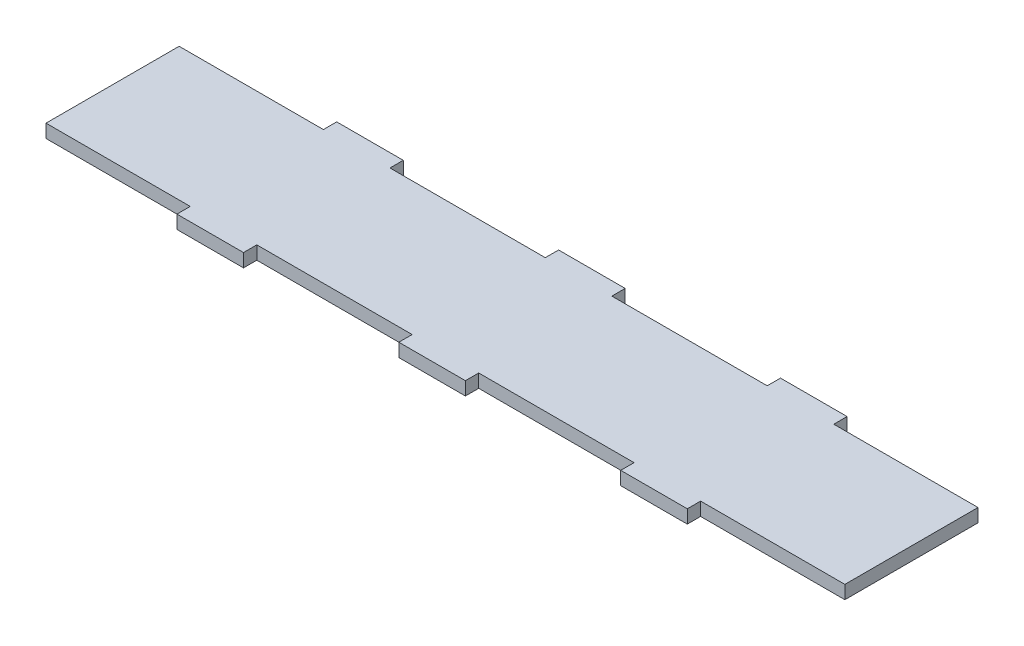
ISO-10303-21;
HEADER;
FILE_DESCRIPTION(('STEP AP214'),'2;1');
FILE_NAME('part.step','',(''),(''),'','','');
FILE_SCHEMA(('AUTOMOTIVE_DESIGN { 1 0 10303 214 1 1 1 1 }'));
ENDSEC;
DATA;
#1=APPLICATION_CONTEXT('core data for automotive mechanical design processes');
#2=APPLICATION_PROTOCOL_DEFINITION('international standard','automotive_design',2000,#1);
#3=PRODUCT_CONTEXT('',#1,'mechanical');
#4=PRODUCT('Part','Part','',(#3));
#5=PRODUCT_RELATED_PRODUCT_CATEGORY('part','',(#4));
#6=PRODUCT_DEFINITION_FORMATION('','',#4);
#7=PRODUCT_DEFINITION_CONTEXT('part definition',#1,'design');
#8=PRODUCT_DEFINITION('design','',#6,#7);
#9=PRODUCT_DEFINITION_SHAPE('','',#8);
#10=(LENGTH_UNIT() NAMED_UNIT(*) SI_UNIT(.MILLI.,.METRE.));
#11=(NAMED_UNIT(*) PLANE_ANGLE_UNIT() SI_UNIT($,.RADIAN.));
#12=(NAMED_UNIT(*) SI_UNIT($,.STERADIAN.) SOLID_ANGLE_UNIT());
#13=UNCERTAINTY_MEASURE_WITH_UNIT(LENGTH_MEASURE(1.E-05),#10,'distance_accuracy_value','');
#14=(GEOMETRIC_REPRESENTATION_CONTEXT(3) GLOBAL_UNCERTAINTY_ASSIGNED_CONTEXT((#13)) GLOBAL_UNIT_ASSIGNED_CONTEXT((#10,
#11,#12)) REPRESENTATION_CONTEXT('',''));
#15=CARTESIAN_POINT('',(0.,0.,0.));
#16=DIRECTION('',(0.,0.,1.));
#17=DIRECTION('',(1.,0.,0.));
#18=AXIS2_PLACEMENT_3D('',#15,#16,#17);
#19=CARTESIAN_POINT('',(14.9999999999999,6.,-72.));
#20=DIRECTION('',(0.,0.,1.));
#21=DIRECTION('',(1.,0.,0.));
#22=AXIS2_PLACEMENT_3D('',#19,#20,#21);
#23=PLANE('',#22);
#24=DIRECTION('',(-1.,0.,0.));
#25=VECTOR('',#24,1.);
#26=CARTESIAN_POINT('',(14.9999999999999,0.,-72.));
#27=LINE('',#26,#25);
#28=CARTESIAN_POINT('',(14.9999999999999,0.,-72.));
#29=VERTEX_POINT('',#28);
#30=CARTESIAN_POINT('',(-15.0000000000001,0.,-72.));
#31=VERTEX_POINT('',#30);
#32=EDGE_CURVE('E253',#29,#31,#27,.T.);
#33=ORIENTED_EDGE('',*,*,#32,.T.);
#34=DIRECTION('',(0.,-1.,0.));
#35=VECTOR('',#34,1.);
#36=CARTESIAN_POINT('',(-15.0000000000001,6.,-72.));
#37=LINE('',#36,#35);
#38=CARTESIAN_POINT('',(-15.0000000000001,6.,-72.));
#39=VERTEX_POINT('',#38);
#40=EDGE_CURVE('E11',#39,#31,#37,.T.);
#41=ORIENTED_EDGE('',*,*,#40,.F.);
#42=DIRECTION('',(-1.,0.,0.));
#43=VECTOR('',#42,1.);
#44=CARTESIAN_POINT('',(14.9999999999999,6.,-72.));
#45=LINE('',#44,#43);
#46=CARTESIAN_POINT('',(14.9999999999999,6.,-72.));
#47=VERTEX_POINT('',#46);
#48=EDGE_CURVE('E307',#47,#39,#45,.T.);
#49=ORIENTED_EDGE('',*,*,#48,.F.);
#50=DIRECTION('',(0.,-1.,0.));
#51=VECTOR('',#50,1.);
#52=CARTESIAN_POINT('',(14.9999999999999,6.,-72.));
#53=LINE('',#52,#51);
#54=EDGE_CURVE('E249',#47,#29,#53,.T.);
#55=ORIENTED_EDGE('',*,*,#54,.T.);
#56=EDGE_LOOP('',(#33,#41,#49,#55));
#57=FACE_BOUND('',#56,.T.);
#58=ADVANCED_FACE('F37',(#57),#23,.F.);
#59=CARTESIAN_POINT('',(-15.0000000000001,6.,-72.));
#60=DIRECTION('',(1.,0.,0.));
#61=DIRECTION('',(0.,0.,-1.));
#62=AXIS2_PLACEMENT_3D('',#59,#60,#61);
#63=PLANE('',#62);
#64=DIRECTION('',(0.,0.,1.));
#65=VECTOR('',#64,1.);
#66=CARTESIAN_POINT('',(-15.0000000000001,0.,-72.));
#67=LINE('',#66,#65);
#68=CARTESIAN_POINT('',(-15.0000000000001,0.,-66.));
#69=VERTEX_POINT('',#68);
#70=EDGE_CURVE('E256',#31,#69,#67,.T.);
#71=ORIENTED_EDGE('',*,*,#70,.T.);
#72=DIRECTION('',(0.,-1.,0.));
#73=VECTOR('',#72,1.);
#74=CARTESIAN_POINT('',(-15.0000000000001,6.,-66.));
#75=LINE('',#74,#73);
#76=CARTESIAN_POINT('',(-15.0000000000001,6.,-66.));
#77=VERTEX_POINT('',#76);
#78=EDGE_CURVE('E45',#77,#69,#75,.T.);
#79=ORIENTED_EDGE('',*,*,#78,.F.);
#80=DIRECTION('',(0.,0.,1.));
#81=VECTOR('',#80,1.);
#82=CARTESIAN_POINT('',(-15.0000000000001,6.,-72.));
#83=LINE('',#82,#81);
#84=EDGE_CURVE('E156',#39,#77,#83,.T.);
#85=ORIENTED_EDGE('',*,*,#84,.F.);
#86=ORIENTED_EDGE('',*,*,#40,.T.);
#87=EDGE_LOOP('',(#71,#79,#85,#86));
#88=FACE_BOUND('',#87,.T.);
#89=ADVANCED_FACE('F465',(#88),#63,.F.);
#90=CARTESIAN_POINT('',(-15.0000000000001,6.,-66.));
#91=DIRECTION('',(0.,0.,1.));
#92=DIRECTION('',(1.,0.,0.));
#93=AXIS2_PLACEMENT_3D('',#90,#91,#92);
#94=PLANE('',#93);
#95=DIRECTION('',(-1.,0.,0.));
#96=VECTOR('',#95,1.);
#97=CARTESIAN_POINT('',(-15.0000000000001,0.,-66.));
#98=LINE('',#97,#96);
#99=CARTESIAN_POINT('',(-85.0000000000001,0.,-66.));
#100=VERTEX_POINT('',#99);
#101=EDGE_CURVE('E258',#69,#100,#98,.T.);
#102=ORIENTED_EDGE('',*,*,#101,.T.);
#103=DIRECTION('',(0.,-1.,0.));
#104=VECTOR('',#103,1.);
#105=CARTESIAN_POINT('',(-85.0000000000001,6.,-66.));
#106=LINE('',#105,#104);
#107=CARTESIAN_POINT('',(-85.0000000000001,6.,-66.));
#108=VERTEX_POINT('',#107);
#109=EDGE_CURVE('E374',#108,#100,#106,.T.);
#110=ORIENTED_EDGE('',*,*,#109,.F.);
#111=DIRECTION('',(-1.,0.,0.));
#112=VECTOR('',#111,1.);
#113=CARTESIAN_POINT('',(-15.0000000000001,6.,-66.));
#114=LINE('',#113,#112);
#115=EDGE_CURVE('E382',#77,#108,#114,.T.);
#116=ORIENTED_EDGE('',*,*,#115,.F.);
#117=ORIENTED_EDGE('',*,*,#78,.T.);
#118=EDGE_LOOP('',(#102,#110,#116,#117));
#119=FACE_BOUND('',#118,.T.);
#120=ADVANCED_FACE('F380',(#119),#94,.F.);
#121=CARTESIAN_POINT('',(-85.0000000000001,6.,-66.));
#122=DIRECTION('',(-1.,0.,0.));
#123=DIRECTION('',(0.,0.,1.));
#124=AXIS2_PLACEMENT_3D('',#121,#122,#123);
#125=PLANE('',#124);
#126=DIRECTION('',(0.,0.,-1.));
#127=VECTOR('',#126,1.);
#128=CARTESIAN_POINT('',(-85.0000000000001,0.,-66.));
#129=LINE('',#128,#127);
#130=CARTESIAN_POINT('',(-85.0000000000001,0.,-72.));
#131=VERTEX_POINT('',#130);
#132=EDGE_CURVE('E260',#100,#131,#129,.T.);
#133=ORIENTED_EDGE('',*,*,#132,.T.);
#134=DIRECTION('',(0.,-1.,0.));
#135=VECTOR('',#134,1.);
#136=CARTESIAN_POINT('',(-85.0000000000001,6.,-72.));
#137=LINE('',#136,#135);
#138=CARTESIAN_POINT('',(-85.0000000000001,6.,-72.));
#139=VERTEX_POINT('',#138);
#140=EDGE_CURVE('E371',#139,#131,#137,.T.);
#141=ORIENTED_EDGE('',*,*,#140,.F.);
#142=DIRECTION('',(0.,0.,-1.));
#143=VECTOR('',#142,1.);
#144=CARTESIAN_POINT('',(-85.0000000000001,6.,-66.));
#145=LINE('',#144,#143);
#146=EDGE_CURVE('E400',#108,#139,#145,.T.);
#147=ORIENTED_EDGE('',*,*,#146,.F.);
#148=ORIENTED_EDGE('',*,*,#109,.T.);
#149=EDGE_LOOP('',(#133,#141,#147,#148));
#150=FACE_BOUND('',#149,.T.);
#151=ADVANCED_FACE('F391',(#150),#125,.F.);
#152=CARTESIAN_POINT('',(-85.0000000000001,6.,-72.));
#153=DIRECTION('',(0.,0.,1.));
#154=DIRECTION('',(1.,0.,0.));
#155=AXIS2_PLACEMENT_3D('',#152,#153,#154);
#156=PLANE('',#155);
#157=DIRECTION('',(-1.,0.,0.));
#158=VECTOR('',#157,1.);
#159=CARTESIAN_POINT('',(-85.0000000000001,0.,-72.));
#160=LINE('',#159,#158);
#161=CARTESIAN_POINT('',(-115.,0.,-72.));
#162=VERTEX_POINT('',#161);
#163=EDGE_CURVE('E262',#131,#162,#160,.T.);
#164=ORIENTED_EDGE('',*,*,#163,.T.);
#165=DIRECTION('',(0.,-1.,0.));
#166=VECTOR('',#165,1.);
#167=CARTESIAN_POINT('',(-115.,6.,-72.));
#168=LINE('',#167,#166);
#169=CARTESIAN_POINT('',(-115.,6.,-72.));
#170=VERTEX_POINT('',#169);
#171=EDGE_CURVE('E368',#170,#162,#168,.T.);
#172=ORIENTED_EDGE('',*,*,#171,.F.);
#173=DIRECTION('',(-1.,0.,0.));
#174=VECTOR('',#173,1.);
#175=CARTESIAN_POINT('',(-85.0000000000001,6.,-72.));
#176=LINE('',#175,#174);
#177=EDGE_CURVE('E397',#139,#170,#176,.T.);
#178=ORIENTED_EDGE('',*,*,#177,.F.);
#179=ORIENTED_EDGE('',*,*,#140,.T.);
#180=EDGE_LOOP('',(#164,#172,#178,#179));
#181=FACE_BOUND('',#180,.T.);
#182=ADVANCED_FACE('F395',(#181),#156,.F.);
#183=CARTESIAN_POINT('',(-115.,6.,-72.));
#184=DIRECTION('',(1.,0.,0.));
#185=DIRECTION('',(0.,0.,-1.));
#186=AXIS2_PLACEMENT_3D('',#183,#184,#185);
#187=PLANE('',#186);
#188=DIRECTION('',(0.,0.,1.));
#189=VECTOR('',#188,1.);
#190=CARTESIAN_POINT('',(-115.,0.,-72.));
#191=LINE('',#190,#189);
#192=CARTESIAN_POINT('',(-115.,0.,-66.));
#193=VERTEX_POINT('',#192);
#194=EDGE_CURVE('E264',#162,#193,#191,.T.);
#195=ORIENTED_EDGE('',*,*,#194,.T.);
#196=DIRECTION('',(0.,-1.,0.));
#197=VECTOR('',#196,1.);
#198=CARTESIAN_POINT('',(-115.,6.,-66.));
#199=LINE('',#198,#197);
#200=CARTESIAN_POINT('',(-115.,6.,-66.));
#201=VERTEX_POINT('',#200);
#202=EDGE_CURVE('E365',#201,#193,#199,.T.);
#203=ORIENTED_EDGE('',*,*,#202,.F.);
#204=DIRECTION('',(0.,0.,1.));
#205=VECTOR('',#204,1.);
#206=CARTESIAN_POINT('',(-115.,6.,-72.));
#207=LINE('',#206,#205);
#208=EDGE_CURVE('E399',#170,#201,#207,.T.);
#209=ORIENTED_EDGE('',*,*,#208,.F.);
#210=ORIENTED_EDGE('',*,*,#171,.T.);
#211=EDGE_LOOP('',(#195,#203,#209,#210));
#212=FACE_BOUND('',#211,.T.);
#213=ADVANCED_FACE('F478',(#212),#187,.F.);
#214=CARTESIAN_POINT('',(-115.,6.,-66.));
#215=DIRECTION('',(0.,0.,1.));
#216=DIRECTION('',(1.,0.,0.));
#217=AXIS2_PLACEMENT_3D('',#214,#215,#216);
#218=PLANE('',#217);
#219=DIRECTION('',(-1.,0.,0.));
#220=VECTOR('',#219,1.);
#221=CARTESIAN_POINT('',(-115.,0.,-66.));
#222=LINE('',#221,#220);
#223=CARTESIAN_POINT('',(-180.,0.,-66.));
#224=VERTEX_POINT('',#223);
#225=EDGE_CURVE('E266',#193,#224,#222,.T.);
#226=ORIENTED_EDGE('',*,*,#225,.T.);
#227=DIRECTION('',(0.,-1.,0.));
#228=VECTOR('',#227,1.);
#229=CARTESIAN_POINT('',(-180.,6.,-66.));
#230=LINE('',#229,#228);
#231=CARTESIAN_POINT('',(-180.,6.,-66.));
#232=VERTEX_POINT('',#231);
#233=EDGE_CURVE('E362',#232,#224,#230,.T.);
#234=ORIENTED_EDGE('',*,*,#233,.F.);
#235=DIRECTION('',(-1.,0.,0.));
#236=VECTOR('',#235,1.);
#237=CARTESIAN_POINT('',(-115.,6.,-66.));
#238=LINE('',#237,#236);
#239=EDGE_CURVE('E402',#201,#232,#238,.T.);
#240=ORIENTED_EDGE('',*,*,#239,.F.);
#241=ORIENTED_EDGE('',*,*,#202,.T.);
#242=EDGE_LOOP('',(#226,#234,#240,#241));
#243=FACE_BOUND('',#242,.T.);
#244=ADVANCED_FACE('F481',(#243),#218,.F.);
#245=CARTESIAN_POINT('',(-180.,6.,-66.));
#246=DIRECTION('',(1.,0.,0.));
#247=DIRECTION('',(0.,0.,-1.));
#248=AXIS2_PLACEMENT_3D('',#245,#246,#247);
#249=PLANE('',#248);
#250=DIRECTION('',(0.,0.,1.));
#251=VECTOR('',#250,1.);
#252=CARTESIAN_POINT('',(-180.,0.,-66.));
#253=LINE('',#252,#251);
#254=CARTESIAN_POINT('',(-180.,0.,-5.99999999999999));
#255=VERTEX_POINT('',#254);
#256=EDGE_CURVE('E268',#224,#255,#253,.T.);
#257=ORIENTED_EDGE('',*,*,#256,.T.);
#258=DIRECTION('',(0.,-1.,0.));
#259=VECTOR('',#258,1.);
#260=CARTESIAN_POINT('',(-180.,6.,-5.99999999999999));
#261=LINE('',#260,#259);
#262=CARTESIAN_POINT('',(-180.,6.,-5.99999999999999));
#263=VERTEX_POINT('',#262);
#264=EDGE_CURVE('E359',#263,#255,#261,.T.);
#265=ORIENTED_EDGE('',*,*,#264,.F.);
#266=DIRECTION('',(0.,0.,1.));
#267=VECTOR('',#266,1.);
#268=CARTESIAN_POINT('',(-180.,6.,-66.));
#269=LINE('',#268,#267);
#270=EDGE_CURVE('E408',#232,#263,#269,.T.);
#271=ORIENTED_EDGE('',*,*,#270,.F.);
#272=ORIENTED_EDGE('',*,*,#233,.T.);
#273=EDGE_LOOP('',(#257,#265,#271,#272));
#274=FACE_BOUND('',#273,.T.);
#275=ADVANCED_FACE('F485',(#274),#249,.F.);
#276=CARTESIAN_POINT('',(-115.,6.,-6.));
#277=DIRECTION('',(0.,0.,-1.));
#278=DIRECTION('',(-1.,0.,0.));
#279=AXIS2_PLACEMENT_3D('',#276,#277,#278);
#280=PLANE('',#279);
#281=DIRECTION('',(1.,0.,0.));
#282=VECTOR('',#281,1.);
#283=CARTESIAN_POINT('',(-115.,0.,-6.));
#284=LINE('',#283,#282);
#285=CARTESIAN_POINT('',(-115.,0.,-6.));
#286=VERTEX_POINT('',#285);
#287=EDGE_CURVE('E270',#255,#286,#284,.T.);
#288=ORIENTED_EDGE('',*,*,#287,.T.);
#289=DIRECTION('',(0.,-1.,0.));
#290=VECTOR('',#289,1.);
#291=CARTESIAN_POINT('',(-115.,6.,-6.));
#292=LINE('',#291,#290);
#293=CARTESIAN_POINT('',(-115.,6.,-6.));
#294=VERTEX_POINT('',#293);
#295=EDGE_CURVE('E356',#294,#286,#292,.T.);
#296=ORIENTED_EDGE('',*,*,#295,.F.);
#297=DIRECTION('',(1.,0.,0.));
#298=VECTOR('',#297,1.);
#299=CARTESIAN_POINT('',(-115.,6.,-6.));
#300=LINE('',#299,#298);
#301=EDGE_CURVE('E410',#263,#294,#300,.T.);
#302=ORIENTED_EDGE('',*,*,#301,.F.);
#303=ORIENTED_EDGE('',*,*,#264,.T.);
#304=EDGE_LOOP('',(#288,#296,#302,#303));
#305=FACE_BOUND('',#304,.T.);
#306=ADVANCED_FACE('F489',(#305),#280,.F.);
#307=CARTESIAN_POINT('',(-115.,6.,0.));
#308=DIRECTION('',(1.,0.,0.));
#309=DIRECTION('',(0.,0.,-1.));
#310=AXIS2_PLACEMENT_3D('',#307,#308,#309);
#311=PLANE('',#310);
#312=DIRECTION('',(0.,0.,1.));
#313=VECTOR('',#312,1.);
#314=CARTESIAN_POINT('',(-115.,0.,0.));
#315=LINE('',#314,#313);
#316=CARTESIAN_POINT('',(-115.,0.,0.));
#317=VERTEX_POINT('',#316);
#318=EDGE_CURVE('E272',#286,#317,#315,.T.);
#319=ORIENTED_EDGE('',*,*,#318,.T.);
#320=DIRECTION('',(0.,-1.,0.));
#321=VECTOR('',#320,1.);
#322=CARTESIAN_POINT('',(-115.,6.,0.));
#323=LINE('',#322,#321);
#324=CARTESIAN_POINT('',(-115.,6.,0.));
#325=VERTEX_POINT('',#324);
#326=EDGE_CURVE('E353',#325,#317,#323,.T.);
#327=ORIENTED_EDGE('',*,*,#326,.F.);
#328=DIRECTION('',(0.,0.,1.));
#329=VECTOR('',#328,1.);
#330=CARTESIAN_POINT('',(-115.,6.,0.));
#331=LINE('',#330,#329);
#332=EDGE_CURVE('E412',#294,#325,#331,.T.);
#333=ORIENTED_EDGE('',*,*,#332,.F.);
#334=ORIENTED_EDGE('',*,*,#295,.T.);
#335=EDGE_LOOP('',(#319,#327,#333,#334));
#336=FACE_BOUND('',#335,.T.);
#337=ADVANCED_FACE('F493',(#336),#311,.F.);
#338=CARTESIAN_POINT('',(-85.,6.,0.));
#339=DIRECTION('',(0.,0.,-1.));
#340=DIRECTION('',(-1.,0.,0.));
#341=AXIS2_PLACEMENT_3D('',#338,#339,#340);
#342=PLANE('',#341);
#343=DIRECTION('',(1.,0.,0.));
#344=VECTOR('',#343,1.);
#345=CARTESIAN_POINT('',(-85.,0.,0.));
#346=LINE('',#345,#344);
#347=CARTESIAN_POINT('',(-85.,0.,0.));
#348=VERTEX_POINT('',#347);
#349=EDGE_CURVE('E274',#317,#348,#346,.T.);
#350=ORIENTED_EDGE('',*,*,#349,.T.);
#351=DIRECTION('',(0.,-1.,0.));
#352=VECTOR('',#351,1.);
#353=CARTESIAN_POINT('',(-85.,6.,0.));
#354=LINE('',#353,#352);
#355=CARTESIAN_POINT('',(-85.,6.,0.));
#356=VERTEX_POINT('',#355);
#357=EDGE_CURVE('E350',#356,#348,#354,.T.);
#358=ORIENTED_EDGE('',*,*,#357,.F.);
#359=DIRECTION('',(1.,0.,0.));
#360=VECTOR('',#359,1.);
#361=CARTESIAN_POINT('',(-85.,6.,0.));
#362=LINE('',#361,#360);
#363=EDGE_CURVE('E414',#325,#356,#362,.T.);
#364=ORIENTED_EDGE('',*,*,#363,.F.);
#365=ORIENTED_EDGE('',*,*,#326,.T.);
#366=EDGE_LOOP('',(#350,#358,#364,#365));
#367=FACE_BOUND('',#366,.T.);
#368=ADVANCED_FACE('F497',(#367),#342,.F.);
#369=CARTESIAN_POINT('',(-85.,6.,-6.));
#370=DIRECTION('',(-1.,0.,0.));
#371=DIRECTION('',(0.,0.,1.));
#372=AXIS2_PLACEMENT_3D('',#369,#370,#371);
#373=PLANE('',#372);
#374=DIRECTION('',(0.,0.,-1.));
#375=VECTOR('',#374,1.);
#376=CARTESIAN_POINT('',(-85.,0.,-6.));
#377=LINE('',#376,#375);
#378=CARTESIAN_POINT('',(-85.,0.,-6.));
#379=VERTEX_POINT('',#378);
#380=EDGE_CURVE('E276',#348,#379,#377,.T.);
#381=ORIENTED_EDGE('',*,*,#380,.T.);
#382=DIRECTION('',(0.,-1.,0.));
#383=VECTOR('',#382,1.);
#384=CARTESIAN_POINT('',(-85.,6.,-6.));
#385=LINE('',#384,#383);
#386=CARTESIAN_POINT('',(-85.,6.,-6.));
#387=VERTEX_POINT('',#386);
#388=EDGE_CURVE('E347',#387,#379,#385,.T.);
#389=ORIENTED_EDGE('',*,*,#388,.F.);
#390=DIRECTION('',(0.,0.,-1.));
#391=VECTOR('',#390,1.);
#392=CARTESIAN_POINT('',(-85.,6.,-6.));
#393=LINE('',#392,#391);
#394=EDGE_CURVE('E416',#356,#387,#393,.T.);
#395=ORIENTED_EDGE('',*,*,#394,.F.);
#396=ORIENTED_EDGE('',*,*,#357,.T.);
#397=EDGE_LOOP('',(#381,#389,#395,#396));
#398=FACE_BOUND('',#397,.T.);
#399=ADVANCED_FACE('F501',(#398),#373,.F.);
#400=CARTESIAN_POINT('',(-15.,6.,-6.00000000000001));
#401=DIRECTION('',(0.,0.,-1.));
#402=DIRECTION('',(-1.,0.,0.));
#403=AXIS2_PLACEMENT_3D('',#400,#401,#402);
#404=PLANE('',#403);
#405=DIRECTION('',(1.,0.,0.));
#406=VECTOR('',#405,1.);
#407=CARTESIAN_POINT('',(-15.,0.,-6.00000000000001));
#408=LINE('',#407,#406);
#409=CARTESIAN_POINT('',(-15.,0.,-6.00000000000001));
#410=VERTEX_POINT('',#409);
#411=EDGE_CURVE('E278',#379,#410,#408,.T.);
#412=ORIENTED_EDGE('',*,*,#411,.T.);
#413=DIRECTION('',(0.,-1.,0.));
#414=VECTOR('',#413,1.);
#415=CARTESIAN_POINT('',(-15.,6.,-6.00000000000001));
#416=LINE('',#415,#414);
#417=CARTESIAN_POINT('',(-15.,6.,-6.00000000000001));
#418=VERTEX_POINT('',#417);
#419=EDGE_CURVE('E344',#418,#410,#416,.T.);
#420=ORIENTED_EDGE('',*,*,#419,.F.);
#421=DIRECTION('',(1.,0.,0.));
#422=VECTOR('',#421,1.);
#423=CARTESIAN_POINT('',(-15.,6.,-6.00000000000001));
#424=LINE('',#423,#422);
#425=EDGE_CURVE('E418',#387,#418,#424,.T.);
#426=ORIENTED_EDGE('',*,*,#425,.F.);
#427=ORIENTED_EDGE('',*,*,#388,.T.);
#428=EDGE_LOOP('',(#412,#420,#426,#427));
#429=FACE_BOUND('',#428,.T.);
#430=ADVANCED_FACE('F505',(#429),#404,.F.);
#431=CARTESIAN_POINT('',(-15.,6.,0.));
#432=DIRECTION('',(1.,0.,0.));
#433=DIRECTION('',(0.,0.,-1.));
#434=AXIS2_PLACEMENT_3D('',#431,#432,#433);
#435=PLANE('',#434);
#436=DIRECTION('',(0.,0.,1.));
#437=VECTOR('',#436,1.);
#438=CARTESIAN_POINT('',(-15.,0.,0.));
#439=LINE('',#438,#437);
#440=CARTESIAN_POINT('',(-15.,0.,0.));
#441=VERTEX_POINT('',#440);
#442=EDGE_CURVE('E280',#410,#441,#439,.T.);
#443=ORIENTED_EDGE('',*,*,#442,.T.);
#444=DIRECTION('',(0.,-1.,0.));
#445=VECTOR('',#444,1.);
#446=CARTESIAN_POINT('',(-15.,6.,0.));
#447=LINE('',#446,#445);
#448=CARTESIAN_POINT('',(-15.,6.,0.));
#449=VERTEX_POINT('',#448);
#450=EDGE_CURVE('E341',#449,#441,#447,.T.);
#451=ORIENTED_EDGE('',*,*,#450,.F.);
#452=DIRECTION('',(0.,0.,1.));
#453=VECTOR('',#452,1.);
#454=CARTESIAN_POINT('',(-15.,6.,0.));
#455=LINE('',#454,#453);
#456=EDGE_CURVE('E420',#418,#449,#455,.T.);
#457=ORIENTED_EDGE('',*,*,#456,.F.);
#458=ORIENTED_EDGE('',*,*,#419,.T.);
#459=EDGE_LOOP('',(#443,#451,#457,#458));
#460=FACE_BOUND('',#459,.T.);
#461=ADVANCED_FACE('F509',(#460),#435,.F.);
#462=CARTESIAN_POINT('',(15.,6.,0.));
#463=DIRECTION('',(0.,0.,-1.));
#464=DIRECTION('',(-1.,0.,0.));
#465=AXIS2_PLACEMENT_3D('',#462,#463,#464);
#466=PLANE('',#465);
#467=DIRECTION('',(1.,0.,0.));
#468=VECTOR('',#467,1.);
#469=CARTESIAN_POINT('',(15.,0.,0.));
#470=LINE('',#469,#468);
#471=CARTESIAN_POINT('',(15.,0.,0.));
#472=VERTEX_POINT('',#471);
#473=EDGE_CURVE('E282',#441,#472,#470,.T.);
#474=ORIENTED_EDGE('',*,*,#473,.T.);
#475=DIRECTION('',(0.,-1.,0.));
#476=VECTOR('',#475,1.);
#477=CARTESIAN_POINT('',(15.,6.,0.));
#478=LINE('',#477,#476);
#479=CARTESIAN_POINT('',(15.,6.,0.));
#480=VERTEX_POINT('',#479);
#481=EDGE_CURVE('E338',#480,#472,#478,.T.);
#482=ORIENTED_EDGE('',*,*,#481,.F.);
#483=DIRECTION('',(1.,0.,0.));
#484=VECTOR('',#483,1.);
#485=CARTESIAN_POINT('',(15.,6.,0.));
#486=LINE('',#485,#484);
#487=EDGE_CURVE('E422',#449,#480,#486,.T.);
#488=ORIENTED_EDGE('',*,*,#487,.F.);
#489=ORIENTED_EDGE('',*,*,#450,.T.);
#490=EDGE_LOOP('',(#474,#482,#488,#489));
#491=FACE_BOUND('',#490,.T.);
#492=ADVANCED_FACE('F513',(#491),#466,.F.);
#493=CARTESIAN_POINT('',(15.,6.,0.));
#494=DIRECTION('',(-1.,0.,0.));
#495=DIRECTION('',(0.,0.,1.));
#496=AXIS2_PLACEMENT_3D('',#493,#494,#495);
#497=PLANE('',#496);
#498=DIRECTION('',(0.,0.,-1.));
#499=VECTOR('',#498,1.);
#500=CARTESIAN_POINT('',(15.,0.,0.));
#501=LINE('',#500,#499);
#502=CARTESIAN_POINT('',(15.,0.,-6.00000000000001));
#503=VERTEX_POINT('',#502);
#504=EDGE_CURVE('E284',#472,#503,#501,.T.);
#505=ORIENTED_EDGE('',*,*,#504,.T.);
#506=DIRECTION('',(0.,-1.,0.));
#507=VECTOR('',#506,1.);
#508=CARTESIAN_POINT('',(15.,6.,-6.00000000000001));
#509=LINE('',#508,#507);
#510=CARTESIAN_POINT('',(15.,6.,-6.00000000000001));
#511=VERTEX_POINT('',#510);
#512=EDGE_CURVE('E335',#511,#503,#509,.T.);
#513=ORIENTED_EDGE('',*,*,#512,.F.);
#514=DIRECTION('',(0.,0.,-1.));
#515=VECTOR('',#514,1.);
#516=CARTESIAN_POINT('',(15.,6.,0.));
#517=LINE('',#516,#515);
#518=EDGE_CURVE('E424',#480,#511,#517,.T.);
#519=ORIENTED_EDGE('',*,*,#518,.F.);
#520=ORIENTED_EDGE('',*,*,#481,.T.);
#521=EDGE_LOOP('',(#505,#513,#519,#520));
#522=FACE_BOUND('',#521,.T.);
#523=ADVANCED_FACE('F517',(#522),#497,.F.);
#524=CARTESIAN_POINT('',(15.,6.,-6.00000000000001));
#525=DIRECTION('',(0.,0.,-1.));
#526=DIRECTION('',(-1.,0.,0.));
#527=AXIS2_PLACEMENT_3D('',#524,#525,#526);
#528=PLANE('',#527);
#529=DIRECTION('',(1.,0.,0.));
#530=VECTOR('',#529,1.);
#531=CARTESIAN_POINT('',(15.,0.,-6.00000000000001));
#532=LINE('',#531,#530);
#533=CARTESIAN_POINT('',(85.,0.,-6.));
#534=VERTEX_POINT('',#533);
#535=EDGE_CURVE('E286',#503,#534,#532,.T.);
#536=ORIENTED_EDGE('',*,*,#535,.T.);
#537=DIRECTION('',(0.,-1.,0.));
#538=VECTOR('',#537,1.);
#539=CARTESIAN_POINT('',(85.,6.,-6.));
#540=LINE('',#539,#538);
#541=CARTESIAN_POINT('',(85.,6.,-6.));
#542=VERTEX_POINT('',#541);
#543=EDGE_CURVE('E332',#542,#534,#540,.T.);
#544=ORIENTED_EDGE('',*,*,#543,.F.);
#545=DIRECTION('',(1.,0.,0.));
#546=VECTOR('',#545,1.);
#547=CARTESIAN_POINT('',(15.,6.,-6.00000000000001));
#548=LINE('',#547,#546);
#549=EDGE_CURVE('E426',#511,#542,#548,.T.);
#550=ORIENTED_EDGE('',*,*,#549,.F.);
#551=ORIENTED_EDGE('',*,*,#512,.T.);
#552=EDGE_LOOP('',(#536,#544,#550,#551));
#553=FACE_BOUND('',#552,.T.);
#554=ADVANCED_FACE('F521',(#553),#528,.F.);
#555=CARTESIAN_POINT('',(85.,6.,-6.));
#556=DIRECTION('',(1.,0.,0.));
#557=DIRECTION('',(0.,0.,-1.));
#558=AXIS2_PLACEMENT_3D('',#555,#556,#557);
#559=PLANE('',#558);
#560=DIRECTION('',(0.,0.,1.));
#561=VECTOR('',#560,1.);
#562=CARTESIAN_POINT('',(85.,0.,-6.));
#563=LINE('',#562,#561);
#564=CARTESIAN_POINT('',(85.,0.,0.));
#565=VERTEX_POINT('',#564);
#566=EDGE_CURVE('E288',#534,#565,#563,.T.);
#567=ORIENTED_EDGE('',*,*,#566,.T.);
#568=DIRECTION('',(0.,-1.,0.));
#569=VECTOR('',#568,1.);
#570=CARTESIAN_POINT('',(85.,6.,0.));
#571=LINE('',#570,#569);
#572=CARTESIAN_POINT('',(85.,6.,0.));
#573=VERTEX_POINT('',#572);
#574=EDGE_CURVE('E329',#573,#565,#571,.T.);
#575=ORIENTED_EDGE('',*,*,#574,.F.);
#576=DIRECTION('',(0.,0.,1.));
#577=VECTOR('',#576,1.);
#578=CARTESIAN_POINT('',(85.,6.,-6.));
#579=LINE('',#578,#577);
#580=EDGE_CURVE('E428',#542,#573,#579,.T.);
#581=ORIENTED_EDGE('',*,*,#580,.F.);
#582=ORIENTED_EDGE('',*,*,#543,.T.);
#583=EDGE_LOOP('',(#567,#575,#581,#582));
#584=FACE_BOUND('',#583,.T.);
#585=ADVANCED_FACE('F525',(#584),#559,.F.);
#586=CARTESIAN_POINT('',(85.,6.,0.));
#587=DIRECTION('',(0.,0.,-1.));
#588=DIRECTION('',(-1.,0.,0.));
#589=AXIS2_PLACEMENT_3D('',#586,#587,#588);
#590=PLANE('',#589);
#591=DIRECTION('',(1.,0.,0.));
#592=VECTOR('',#591,1.);
#593=CARTESIAN_POINT('',(85.,0.,0.));
#594=LINE('',#593,#592);
#595=CARTESIAN_POINT('',(115.,0.,0.));
#596=VERTEX_POINT('',#595);
#597=EDGE_CURVE('E290',#565,#596,#594,.T.);
#598=ORIENTED_EDGE('',*,*,#597,.T.);
#599=DIRECTION('',(0.,-1.,0.));
#600=VECTOR('',#599,1.);
#601=CARTESIAN_POINT('',(115.,6.,0.));
#602=LINE('',#601,#600);
#603=CARTESIAN_POINT('',(115.,6.,0.));
#604=VERTEX_POINT('',#603);
#605=EDGE_CURVE('E326',#604,#596,#602,.T.);
#606=ORIENTED_EDGE('',*,*,#605,.F.);
#607=DIRECTION('',(1.,0.,0.));
#608=VECTOR('',#607,1.);
#609=CARTESIAN_POINT('',(85.,6.,0.));
#610=LINE('',#609,#608);
#611=EDGE_CURVE('E430',#573,#604,#610,.T.);
#612=ORIENTED_EDGE('',*,*,#611,.F.);
#613=ORIENTED_EDGE('',*,*,#574,.T.);
#614=EDGE_LOOP('',(#598,#606,#612,#613));
#615=FACE_BOUND('',#614,.T.);
#616=ADVANCED_FACE('F529',(#615),#590,.F.);
#617=CARTESIAN_POINT('',(115.,6.,0.));
#618=DIRECTION('',(-1.,0.,0.));
#619=DIRECTION('',(0.,0.,1.));
#620=AXIS2_PLACEMENT_3D('',#617,#618,#619);
#621=PLANE('',#620);
#622=DIRECTION('',(0.,0.,-1.));
#623=VECTOR('',#622,1.);
#624=CARTESIAN_POINT('',(115.,0.,0.));
#625=LINE('',#624,#623);
#626=CARTESIAN_POINT('',(115.,0.,-6.));
#627=VERTEX_POINT('',#626);
#628=EDGE_CURVE('E292',#596,#627,#625,.T.);
#629=ORIENTED_EDGE('',*,*,#628,.T.);
#630=DIRECTION('',(0.,-1.,0.));
#631=VECTOR('',#630,1.);
#632=CARTESIAN_POINT('',(115.,6.,-6.));
#633=LINE('',#632,#631);
#634=CARTESIAN_POINT('',(115.,6.,-6.));
#635=VERTEX_POINT('',#634);
#636=EDGE_CURVE('E323',#635,#627,#633,.T.);
#637=ORIENTED_EDGE('',*,*,#636,.F.);
#638=DIRECTION('',(0.,0.,-1.));
#639=VECTOR('',#638,1.);
#640=CARTESIAN_POINT('',(115.,6.,0.));
#641=LINE('',#640,#639);
#642=EDGE_CURVE('E432',#604,#635,#641,.T.);
#643=ORIENTED_EDGE('',*,*,#642,.F.);
#644=ORIENTED_EDGE('',*,*,#605,.T.);
#645=EDGE_LOOP('',(#629,#637,#643,#644));
#646=FACE_BOUND('',#645,.T.);
#647=ADVANCED_FACE('F533',(#646),#621,.F.);
#648=CARTESIAN_POINT('',(115.,6.,-6.));
#649=DIRECTION('',(0.,0.,-1.));
#650=DIRECTION('',(-1.,0.,0.));
#651=AXIS2_PLACEMENT_3D('',#648,#649,#650);
#652=PLANE('',#651);
#653=DIRECTION('',(1.,0.,0.));
#654=VECTOR('',#653,1.);
#655=CARTESIAN_POINT('',(115.,0.,-6.));
#656=LINE('',#655,#654);
#657=CARTESIAN_POINT('',(180.,0.,-5.99999999999999));
#658=VERTEX_POINT('',#657);
#659=EDGE_CURVE('E294',#627,#658,#656,.T.);
#660=ORIENTED_EDGE('',*,*,#659,.T.);
#661=DIRECTION('',(0.,-1.,0.));
#662=VECTOR('',#661,1.);
#663=CARTESIAN_POINT('',(180.,6.,-5.99999999999999));
#664=LINE('',#663,#662);
#665=CARTESIAN_POINT('',(180.,6.,-5.99999999999999));
#666=VERTEX_POINT('',#665);
#667=EDGE_CURVE('E320',#666,#658,#664,.T.);
#668=ORIENTED_EDGE('',*,*,#667,.F.);
#669=DIRECTION('',(1.,0.,0.));
#670=VECTOR('',#669,1.);
#671=CARTESIAN_POINT('',(115.,6.,-6.));
#672=LINE('',#671,#670);
#673=EDGE_CURVE('E434',#635,#666,#672,.T.);
#674=ORIENTED_EDGE('',*,*,#673,.F.);
#675=ORIENTED_EDGE('',*,*,#636,.T.);
#676=EDGE_LOOP('',(#660,#668,#674,#675));
#677=FACE_BOUND('',#676,.T.);
#678=ADVANCED_FACE('F537',(#677),#652,.F.);
#679=CARTESIAN_POINT('',(180.,6.,-66.));
#680=DIRECTION('',(-1.,0.,0.));
#681=DIRECTION('',(0.,0.,1.));
#682=AXIS2_PLACEMENT_3D('',#679,#680,#681);
#683=PLANE('',#682);
#684=DIRECTION('',(0.,0.,-1.));
#685=VECTOR('',#684,1.);
#686=CARTESIAN_POINT('',(180.,0.,-66.));
#687=LINE('',#686,#685);
#688=CARTESIAN_POINT('',(180.,0.,-66.));
#689=VERTEX_POINT('',#688);
#690=EDGE_CURVE('E296',#658,#689,#687,.T.);
#691=ORIENTED_EDGE('',*,*,#690,.T.);
#692=DIRECTION('',(0.,-1.,0.));
#693=VECTOR('',#692,1.);
#694=CARTESIAN_POINT('',(180.,6.,-66.));
#695=LINE('',#694,#693);
#696=CARTESIAN_POINT('',(180.,6.,-66.));
#697=VERTEX_POINT('',#696);
#698=EDGE_CURVE('E317',#697,#689,#695,.T.);
#699=ORIENTED_EDGE('',*,*,#698,.F.);
#700=DIRECTION('',(0.,0.,-1.));
#701=VECTOR('',#700,1.);
#702=CARTESIAN_POINT('',(180.,6.,-66.));
#703=LINE('',#702,#701);
#704=EDGE_CURVE('E436',#666,#697,#703,.T.);
#705=ORIENTED_EDGE('',*,*,#704,.F.);
#706=ORIENTED_EDGE('',*,*,#667,.T.);
#707=EDGE_LOOP('',(#691,#699,#705,#706));
#708=FACE_BOUND('',#707,.T.);
#709=ADVANCED_FACE('F541',(#708),#683,.F.);
#710=CARTESIAN_POINT('',(115.,6.,-66.));
#711=DIRECTION('',(0.,0.,1.));
#712=DIRECTION('',(1.,0.,0.));
#713=AXIS2_PLACEMENT_3D('',#710,#711,#712);
#714=PLANE('',#713);
#715=DIRECTION('',(-1.,0.,0.));
#716=VECTOR('',#715,1.);
#717=CARTESIAN_POINT('',(115.,0.,-66.));
#718=LINE('',#717,#716);
#719=CARTESIAN_POINT('',(115.,0.,-66.));
#720=VERTEX_POINT('',#719);
#721=EDGE_CURVE('E298',#689,#720,#718,.T.);
#722=ORIENTED_EDGE('',*,*,#721,.T.);
#723=DIRECTION('',(0.,-1.,0.));
#724=VECTOR('',#723,1.);
#725=CARTESIAN_POINT('',(115.,6.,-66.));
#726=LINE('',#725,#724);
#727=CARTESIAN_POINT('',(115.,6.,-66.));
#728=VERTEX_POINT('',#727);
#729=EDGE_CURVE('E314',#728,#720,#726,.T.);
#730=ORIENTED_EDGE('',*,*,#729,.F.);
#731=DIRECTION('',(-1.,0.,0.));
#732=VECTOR('',#731,1.);
#733=CARTESIAN_POINT('',(115.,6.,-66.));
#734=LINE('',#733,#732);
#735=EDGE_CURVE('E438',#697,#728,#734,.T.);
#736=ORIENTED_EDGE('',*,*,#735,.F.);
#737=ORIENTED_EDGE('',*,*,#698,.T.);
#738=EDGE_LOOP('',(#722,#730,#736,#737));
#739=FACE_BOUND('',#738,.T.);
#740=ADVANCED_FACE('F545',(#739),#714,.F.);
#741=CARTESIAN_POINT('',(115.,6.,-72.));
#742=DIRECTION('',(-1.,0.,0.));
#743=DIRECTION('',(0.,0.,1.));
#744=AXIS2_PLACEMENT_3D('',#741,#742,#743);
#745=PLANE('',#744);
#746=DIRECTION('',(0.,0.,-1.));
#747=VECTOR('',#746,1.);
#748=CARTESIAN_POINT('',(115.,0.,-72.));
#749=LINE('',#748,#747);
#750=CARTESIAN_POINT('',(115.,0.,-72.));
#751=VERTEX_POINT('',#750);
#752=EDGE_CURVE('E300',#720,#751,#749,.T.);
#753=ORIENTED_EDGE('',*,*,#752,.T.);
#754=DIRECTION('',(0.,-1.,0.));
#755=VECTOR('',#754,1.);
#756=CARTESIAN_POINT('',(115.,6.,-72.));
#757=LINE('',#756,#755);
#758=CARTESIAN_POINT('',(115.,6.,-72.));
#759=VERTEX_POINT('',#758);
#760=EDGE_CURVE('E311',#759,#751,#757,.T.);
#761=ORIENTED_EDGE('',*,*,#760,.F.);
#762=DIRECTION('',(0.,0.,-1.));
#763=VECTOR('',#762,1.);
#764=CARTESIAN_POINT('',(115.,6.,-72.));
#765=LINE('',#764,#763);
#766=EDGE_CURVE('E440',#728,#759,#765,.T.);
#767=ORIENTED_EDGE('',*,*,#766,.F.);
#768=ORIENTED_EDGE('',*,*,#729,.T.);
#769=EDGE_LOOP('',(#753,#761,#767,#768));
#770=FACE_BOUND('',#769,.T.);
#771=ADVANCED_FACE('F446',(#770),#745,.F.);
#772=CARTESIAN_POINT('',(84.9999999999998,6.,-72.));
#773=DIRECTION('',(0.,0.,1.));
#774=DIRECTION('',(1.,0.,0.));
#775=AXIS2_PLACEMENT_3D('',#772,#773,#774);
#776=PLANE('',#775);
#777=DIRECTION('',(-1.,0.,0.));
#778=VECTOR('',#777,1.);
#779=CARTESIAN_POINT('',(84.9999999999998,0.,-72.));
#780=LINE('',#779,#778);
#781=CARTESIAN_POINT('',(84.9999999999998,0.,-72.));
#782=VERTEX_POINT('',#781);
#783=EDGE_CURVE('E302',#751,#782,#780,.T.);
#784=ORIENTED_EDGE('',*,*,#783,.T.);
#785=DIRECTION('',(0.,-1.,0.));
#786=VECTOR('',#785,1.);
#787=CARTESIAN_POINT('',(84.9999999999998,6.,-72.));
#788=LINE('',#787,#786);
#789=CARTESIAN_POINT('',(84.9999999999998,6.,-72.));
#790=VERTEX_POINT('',#789);
#791=EDGE_CURVE('E244',#790,#782,#788,.T.);
#792=ORIENTED_EDGE('',*,*,#791,.F.);
#793=DIRECTION('',(-1.,0.,0.));
#794=VECTOR('',#793,1.);
#795=CARTESIAN_POINT('',(84.9999999999998,6.,-72.));
#796=LINE('',#795,#794);
#797=EDGE_CURVE('E235',#759,#790,#796,.T.);
#798=ORIENTED_EDGE('',*,*,#797,.F.);
#799=ORIENTED_EDGE('',*,*,#760,.T.);
#800=EDGE_LOOP('',(#784,#792,#798,#799));
#801=FACE_BOUND('',#800,.T.);
#802=ADVANCED_FACE('F450',(#801),#776,.F.);
#803=CARTESIAN_POINT('',(84.9999999999998,6.,-66.));
#804=DIRECTION('',(1.,0.,0.));
#805=DIRECTION('',(0.,0.,-1.));
#806=AXIS2_PLACEMENT_3D('',#803,#804,#805);
#807=PLANE('',#806);
#808=DIRECTION('',(0.,0.,1.));
#809=VECTOR('',#808,1.);
#810=CARTESIAN_POINT('',(84.9999999999998,0.,-66.));
#811=LINE('',#810,#809);
#812=CARTESIAN_POINT('',(84.9999999999998,0.,-66.));
#813=VERTEX_POINT('',#812);
#814=EDGE_CURVE('E243',#782,#813,#811,.T.);
#815=ORIENTED_EDGE('',*,*,#814,.T.);
#816=DIRECTION('',(0.,-1.,0.));
#817=VECTOR('',#816,1.);
#818=CARTESIAN_POINT('',(84.9999999999998,6.,-66.));
#819=LINE('',#818,#817);
#820=CARTESIAN_POINT('',(84.9999999999998,6.,-66.));
#821=VERTEX_POINT('',#820);
#822=EDGE_CURVE('E240',#821,#813,#819,.T.);
#823=ORIENTED_EDGE('',*,*,#822,.F.);
#824=DIRECTION('',(0.,0.,1.));
#825=VECTOR('',#824,1.);
#826=CARTESIAN_POINT('',(84.9999999999998,6.,-66.));
#827=LINE('',#826,#825);
#828=EDGE_CURVE('E229',#790,#821,#827,.T.);
#829=ORIENTED_EDGE('',*,*,#828,.F.);
#830=ORIENTED_EDGE('',*,*,#791,.T.);
#831=EDGE_LOOP('',(#815,#823,#829,#830));
#832=FACE_BOUND('',#831,.T.);
#833=ADVANCED_FACE('F241',(#832),#807,.F.);
#834=CARTESIAN_POINT('',(14.9999999999999,6.,-66.));
#835=DIRECTION('',(0.,0.,1.));
#836=DIRECTION('',(1.,0.,0.));
#837=AXIS2_PLACEMENT_3D('',#834,#835,#836);
#838=PLANE('',#837);
#839=DIRECTION('',(-1.,0.,0.));
#840=VECTOR('',#839,1.);
#841=CARTESIAN_POINT('',(14.9999999999999,0.,-66.));
#842=LINE('',#841,#840);
#843=CARTESIAN_POINT('',(14.9999999999999,0.,-66.));
#844=VERTEX_POINT('',#843);
#845=EDGE_CURVE('E142',#813,#844,#842,.T.);
#846=ORIENTED_EDGE('',*,*,#845,.T.);
#847=DIRECTION('',(0.,-1.,0.));
#848=VECTOR('',#847,1.);
#849=CARTESIAN_POINT('',(14.9999999999999,6.,-66.));
#850=LINE('',#849,#848);
#851=CARTESIAN_POINT('',(14.9999999999999,6.,-66.));
#852=VERTEX_POINT('',#851);
#853=EDGE_CURVE('E245',#852,#844,#850,.T.);
#854=ORIENTED_EDGE('',*,*,#853,.F.);
#855=DIRECTION('',(-1.,0.,0.));
#856=VECTOR('',#855,1.);
#857=CARTESIAN_POINT('',(14.9999999999999,6.,-66.));
#858=LINE('',#857,#856);
#859=EDGE_CURVE('E233',#821,#852,#858,.T.);
#860=ORIENTED_EDGE('',*,*,#859,.F.);
#861=ORIENTED_EDGE('',*,*,#822,.T.);
#862=EDGE_LOOP('',(#846,#854,#860,#861));
#863=FACE_BOUND('',#862,.T.);
#864=ADVANCED_FACE('F247',(#863),#838,.F.);
#865=CARTESIAN_POINT('',(14.9999999999999,6.,-72.));
#866=DIRECTION('',(-1.,0.,0.));
#867=DIRECTION('',(0.,0.,1.));
#868=AXIS2_PLACEMENT_3D('',#865,#866,#867);
#869=PLANE('',#868);
#870=DIRECTION('',(0.,0.,-1.));
#871=VECTOR('',#870,1.);
#872=CARTESIAN_POINT('',(14.9999999999999,0.,-72.));
#873=LINE('',#872,#871);
#874=EDGE_CURVE('E148',#844,#29,#873,.T.);
#875=ORIENTED_EDGE('',*,*,#874,.T.);
#876=ORIENTED_EDGE('',*,*,#54,.F.);
#877=DIRECTION('',(0.,0.,-1.));
#878=VECTOR('',#877,1.);
#879=CARTESIAN_POINT('',(14.9999999999999,6.,-72.));
#880=LINE('',#879,#878);
#881=EDGE_CURVE('E53',#852,#47,#880,.T.);
#882=ORIENTED_EDGE('',*,*,#881,.F.);
#883=ORIENTED_EDGE('',*,*,#853,.T.);
#884=EDGE_LOOP('',(#875,#876,#882,#883));
#885=FACE_BOUND('',#884,.T.);
#886=ADVANCED_FACE('F454',(#885),#869,.F.);
#887=CARTESIAN_POINT('',(0.,6.,0.));
#888=DIRECTION('',(0.,1.,0.));
#889=DIRECTION('',(0.,0.,1.));
#890=AXIS2_PLACEMENT_3D('',#887,#888,#889);
#891=PLANE('',#890);
#892=ORIENTED_EDGE('',*,*,#48,.T.);
#893=ORIENTED_EDGE('',*,*,#84,.T.);
#894=ORIENTED_EDGE('',*,*,#115,.T.);
#895=ORIENTED_EDGE('',*,*,#146,.T.);
#896=ORIENTED_EDGE('',*,*,#177,.T.);
#897=ORIENTED_EDGE('',*,*,#208,.T.);
#898=ORIENTED_EDGE('',*,*,#239,.T.);
#899=ORIENTED_EDGE('',*,*,#270,.T.);
#900=ORIENTED_EDGE('',*,*,#301,.T.);
#901=ORIENTED_EDGE('',*,*,#332,.T.);
#902=ORIENTED_EDGE('',*,*,#363,.T.);
#903=ORIENTED_EDGE('',*,*,#394,.T.);
#904=ORIENTED_EDGE('',*,*,#425,.T.);
#905=ORIENTED_EDGE('',*,*,#456,.T.);
#906=ORIENTED_EDGE('',*,*,#487,.T.);
#907=ORIENTED_EDGE('',*,*,#518,.T.);
#908=ORIENTED_EDGE('',*,*,#549,.T.);
#909=ORIENTED_EDGE('',*,*,#580,.T.);
#910=ORIENTED_EDGE('',*,*,#611,.T.);
#911=ORIENTED_EDGE('',*,*,#642,.T.);
#912=ORIENTED_EDGE('',*,*,#673,.T.);
#913=ORIENTED_EDGE('',*,*,#704,.T.);
#914=ORIENTED_EDGE('',*,*,#735,.T.);
#915=ORIENTED_EDGE('',*,*,#766,.T.);
#916=ORIENTED_EDGE('',*,*,#797,.T.);
#917=ORIENTED_EDGE('',*,*,#828,.T.);
#918=ORIENTED_EDGE('',*,*,#859,.T.);
#919=ORIENTED_EDGE('',*,*,#881,.T.);
#920=EDGE_LOOP('',(#892,#893,#894,#895,#896,#897,#898,#899,#900,#901,#902,#903,#904,#905,#906,
#907,#908,#909,#910,#911,#912,#913,#914,#915,#916,#917,#918,#919));
#921=FACE_BOUND('',#920,.T.);
#922=ADVANCED_FACE('F231',(#921),#891,.T.);
#923=CARTESIAN_POINT('',(0.,0.,0.));
#924=DIRECTION('',(0.,1.,0.));
#925=DIRECTION('',(0.,0.,1.));
#926=AXIS2_PLACEMENT_3D('',#923,#924,#925);
#927=PLANE('',#926);
#928=ORIENTED_EDGE('',*,*,#32,.F.);
#929=ORIENTED_EDGE('',*,*,#874,.F.);
#930=ORIENTED_EDGE('',*,*,#845,.F.);
#931=ORIENTED_EDGE('',*,*,#814,.F.);
#932=ORIENTED_EDGE('',*,*,#783,.F.);
#933=ORIENTED_EDGE('',*,*,#752,.F.);
#934=ORIENTED_EDGE('',*,*,#721,.F.);
#935=ORIENTED_EDGE('',*,*,#690,.F.);
#936=ORIENTED_EDGE('',*,*,#659,.F.);
#937=ORIENTED_EDGE('',*,*,#628,.F.);
#938=ORIENTED_EDGE('',*,*,#597,.F.);
#939=ORIENTED_EDGE('',*,*,#566,.F.);
#940=ORIENTED_EDGE('',*,*,#535,.F.);
#941=ORIENTED_EDGE('',*,*,#504,.F.);
#942=ORIENTED_EDGE('',*,*,#473,.F.);
#943=ORIENTED_EDGE('',*,*,#442,.F.);
#944=ORIENTED_EDGE('',*,*,#411,.F.);
#945=ORIENTED_EDGE('',*,*,#380,.F.);
#946=ORIENTED_EDGE('',*,*,#349,.F.);
#947=ORIENTED_EDGE('',*,*,#318,.F.);
#948=ORIENTED_EDGE('',*,*,#287,.F.);
#949=ORIENTED_EDGE('',*,*,#256,.F.);
#950=ORIENTED_EDGE('',*,*,#225,.F.);
#951=ORIENTED_EDGE('',*,*,#194,.F.);
#952=ORIENTED_EDGE('',*,*,#163,.F.);
#953=ORIENTED_EDGE('',*,*,#132,.F.);
#954=ORIENTED_EDGE('',*,*,#101,.F.);
#955=ORIENTED_EDGE('',*,*,#70,.F.);
#956=EDGE_LOOP('',(#928,#929,#930,#931,#932,#933,#934,#935,#936,#937,#938,#939,#940,#941,#942,
#943,#944,#945,#946,#947,#948,#949,#950,#951,#952,#953,#954,#955));
#957=FACE_BOUND('',#956,.T.);
#958=ADVANCED_FACE('F386',(#957),#927,.F.);
#959=CLOSED_SHELL('',(#58,#89,#120,#151,#182,#213,#244,#275,#306,#337,#368,#399,#430,#461,#492,
#523,#554,#585,#616,#647,#678,#709,#740,#771,#802,#833,#864,#886,#922,#958));
#960=MANIFOLD_SOLID_BREP('B2',#959);
#961=ADVANCED_BREP_SHAPE_REPRESENTATION('',(#18,#960),#14);
#962=SHAPE_DEFINITION_REPRESENTATION(#9,#961);
ENDSEC;
END-ISO-10303-21;
